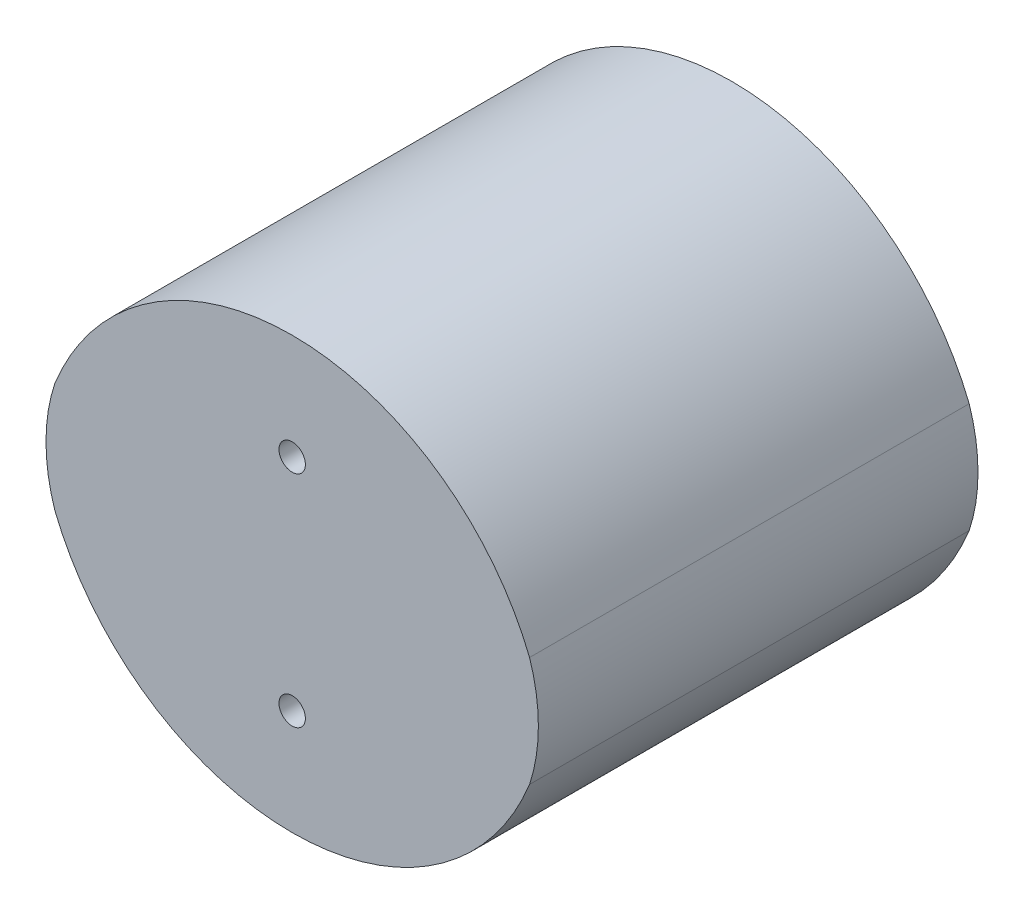
ISO-10303-21;
HEADER;
FILE_DESCRIPTION(('STEP AP214'),'2;1');
FILE_NAME('part.step','',(''),(''),'','','');
FILE_SCHEMA(('AUTOMOTIVE_DESIGN { 1 0 10303 214 1 1 1 1 }'));
ENDSEC;
DATA;
#1=APPLICATION_CONTEXT('core data for automotive mechanical design processes');
#2=APPLICATION_PROTOCOL_DEFINITION('international standard','automotive_design',2000,#1);
#3=PRODUCT_CONTEXT('',#1,'mechanical');
#4=PRODUCT('Part','Part','',(#3));
#5=PRODUCT_RELATED_PRODUCT_CATEGORY('part','',(#4));
#6=PRODUCT_DEFINITION_FORMATION('','',#4);
#7=PRODUCT_DEFINITION_CONTEXT('part definition',#1,'design');
#8=PRODUCT_DEFINITION('design','',#6,#7);
#9=PRODUCT_DEFINITION_SHAPE('','',#8);
#10=(LENGTH_UNIT() NAMED_UNIT(*) SI_UNIT(.MILLI.,.METRE.));
#11=(NAMED_UNIT(*) PLANE_ANGLE_UNIT() SI_UNIT($,.RADIAN.));
#12=(NAMED_UNIT(*) SI_UNIT($,.STERADIAN.) SOLID_ANGLE_UNIT());
#13=UNCERTAINTY_MEASURE_WITH_UNIT(LENGTH_MEASURE(1.E-05),#10,'distance_accuracy_value','');
#14=(GEOMETRIC_REPRESENTATION_CONTEXT(3) GLOBAL_UNCERTAINTY_ASSIGNED_CONTEXT((#13)) GLOBAL_UNIT_ASSIGNED_CONTEXT((#10,
#11,#12)) REPRESENTATION_CONTEXT('',''));
#15=CARTESIAN_POINT('',(0.,0.,0.));
#16=DIRECTION('',(0.,0.,1.));
#17=DIRECTION('',(1.,0.,0.));
#18=AXIS2_PLACEMENT_3D('',#15,#16,#17);
#19=CARTESIAN_POINT('',(4.,-2.2975846996084,0.));
#20=DIRECTION('',(0.,0.,-1.));
#21=DIRECTION('',(-1.,0.,0.));
#22=AXIS2_PLACEMENT_3D('',#19,#20,#21);
#23=PLANE('',#22);
#24=CARTESIAN_POINT('',(0.,12.5,0.));
#25=DIRECTION('',(0.,0.,1.));
#26=DIRECTION('',(1.,0.,0.));
#27=AXIS2_PLACEMENT_3D('',#24,#25,#26);
#28=CIRCLE('',#27,1.49999999999999);
#29=CARTESIAN_POINT('',(1.49999999999999,12.5,0.));
#30=VERTEX_POINT('',#29);
#31=EDGE_CURVE('E116',#30,#30,#28,.T.);
#32=ORIENTED_EDGE('',*,*,#31,.T.);
#33=EDGE_LOOP('',(#32));
#34=FACE_BOUND('',#33,.T.);
#35=CARTESIAN_POINT('',(0.,-4.5951693992168,0.));
#36=DIRECTION('',(0.,0.,1.));
#37=DIRECTION('',(-1.,0.,0.));
#38=AXIS2_PLACEMENT_3D('',#35,#36,#37);
#39=CIRCLE('',#38,29.0951693992168);
#40=CARTESIAN_POINT('',(26.9983551919633,6.25,0.));
#41=VERTEX_POINT('',#40);
#42=CARTESIAN_POINT('',(-26.9983551919633,6.25,0.));
#43=VERTEX_POINT('',#42);
#44=EDGE_CURVE('E97',#41,#43,#39,.T.);
#45=ORIENTED_EDGE('',*,*,#44,.F.);
#46=CARTESIAN_POINT('',(8.,0.,0.));
#47=DIRECTION('',(0.,0.,1.));
#48=DIRECTION('',(-1.,0.,0.));
#49=AXIS2_PLACEMENT_3D('',#46,#47,#48);
#50=CIRCLE('',#49,20.);
#51=CARTESIAN_POINT('',(26.9983551919633,-6.25,0.));
#52=VERTEX_POINT('',#51);
#53=EDGE_CURVE('E73',#52,#41,#50,.T.);
#54=ORIENTED_EDGE('',*,*,#53,.F.);
#55=CARTESIAN_POINT('',(0.,4.5951693992168,0.));
#56=DIRECTION('',(0.,0.,1.));
#57=DIRECTION('',(1.,0.,0.));
#58=AXIS2_PLACEMENT_3D('',#55,#56,#57);
#59=CIRCLE('',#58,29.0951693992168);
#60=CARTESIAN_POINT('',(-26.9983551919633,-6.25,0.));
#61=VERTEX_POINT('',#60);
#62=EDGE_CURVE('E67',#61,#52,#59,.T.);
#63=ORIENTED_EDGE('',*,*,#62,.F.);
#64=CARTESIAN_POINT('',(-8.,0.,0.));
#65=DIRECTION('',(0.,0.,1.));
#66=DIRECTION('',(1.,0.,0.));
#67=AXIS2_PLACEMENT_3D('',#64,#65,#66);
#68=CIRCLE('',#67,20.);
#69=EDGE_CURVE('E89',#43,#61,#68,.T.);
#70=ORIENTED_EDGE('',*,*,#69,.F.);
#71=EDGE_LOOP('',(#45,#54,#63,#70));
#72=FACE_BOUND('',#71,.T.);
#73=CARTESIAN_POINT('',(0.,-12.5,0.));
#74=DIRECTION('',(0.,0.,1.));
#75=DIRECTION('',(1.,0.,0.));
#76=AXIS2_PLACEMENT_3D('',#73,#74,#75);
#77=CIRCLE('',#76,1.49999999999999);
#78=CARTESIAN_POINT('',(1.49999999999999,-12.5,0.));
#79=VERTEX_POINT('',#78);
#80=EDGE_CURVE('E100',#79,#79,#77,.T.);
#81=ORIENTED_EDGE('',*,*,#80,.T.);
#82=EDGE_LOOP('',(#81));
#83=FACE_BOUND('',#82,.T.);
#84=ADVANCED_FACE('F33',(#34,#72,#83),#23,.T.);
#85=CARTESIAN_POINT('',(0.,-4.5951693992168,50.));
#86=DIRECTION('',(0.,0.,-1.));
#87=DIRECTION('',(-1.,0.,0.));
#88=AXIS2_PLACEMENT_3D('',#85,#86,#87);
#89=CYLINDRICAL_SURFACE('',#88,29.0951693992168);
#90=ORIENTED_EDGE('',*,*,#44,.T.);
#91=DIRECTION('',(0.,0.,-1.));
#92=VECTOR('',#91,1.);
#93=CARTESIAN_POINT('',(-26.9983551919633,6.25,50.));
#94=LINE('',#93,#92);
#95=CARTESIAN_POINT('',(-26.9983551919633,6.25,50.));
#96=VERTEX_POINT('',#95);
#97=EDGE_CURVE('E11',#96,#43,#94,.T.);
#98=ORIENTED_EDGE('',*,*,#97,.F.);
#99=CARTESIAN_POINT('',(0.,-4.5951693992168,50.));
#100=DIRECTION('',(0.,0.,1.));
#101=DIRECTION('',(-1.,0.,0.));
#102=AXIS2_PLACEMENT_3D('',#99,#100,#101);
#103=CIRCLE('',#102,29.0951693992168);
#104=CARTESIAN_POINT('',(26.9983551919633,6.25,50.));
#105=VERTEX_POINT('',#104);
#106=EDGE_CURVE('E85',#105,#96,#103,.T.);
#107=ORIENTED_EDGE('',*,*,#106,.F.);
#108=DIRECTION('',(0.,0.,-1.));
#109=VECTOR('',#108,1.);
#110=CARTESIAN_POINT('',(26.9983551919633,6.25,50.));
#111=LINE('',#110,#109);
#112=EDGE_CURVE('E93',#105,#41,#111,.T.);
#113=ORIENTED_EDGE('',*,*,#112,.T.);
#114=EDGE_LOOP('',(#90,#98,#107,#113));
#115=FACE_BOUND('',#114,.T.);
#116=ADVANCED_FACE('F35',(#115),#89,.T.);
#117=CARTESIAN_POINT('',(-8.,0.,50.));
#118=DIRECTION('',(0.,0.,-1.));
#119=DIRECTION('',(-1.,0.,0.));
#120=AXIS2_PLACEMENT_3D('',#117,#118,#119);
#121=CYLINDRICAL_SURFACE('',#120,20.);
#122=ORIENTED_EDGE('',*,*,#69,.T.);
#123=DIRECTION('',(0.,0.,-1.));
#124=VECTOR('',#123,1.);
#125=CARTESIAN_POINT('',(-26.9983551919633,-6.25,50.));
#126=LINE('',#125,#124);
#127=CARTESIAN_POINT('',(-26.9983551919633,-6.25,50.));
#128=VERTEX_POINT('',#127);
#129=EDGE_CURVE('E42',#128,#61,#126,.T.);
#130=ORIENTED_EDGE('',*,*,#129,.F.);
#131=CARTESIAN_POINT('',(-8.,0.,50.));
#132=DIRECTION('',(0.,0.,1.));
#133=DIRECTION('',(1.,0.,0.));
#134=AXIS2_PLACEMENT_3D('',#131,#132,#133);
#135=CIRCLE('',#134,20.);
#136=EDGE_CURVE('E80',#96,#128,#135,.T.);
#137=ORIENTED_EDGE('',*,*,#136,.F.);
#138=ORIENTED_EDGE('',*,*,#97,.T.);
#139=EDGE_LOOP('',(#122,#130,#137,#138));
#140=FACE_BOUND('',#139,.T.);
#141=ADVANCED_FACE('F88',(#140),#121,.T.);
#142=CARTESIAN_POINT('',(0.,4.5951693992168,50.));
#143=DIRECTION('',(0.,0.,-1.));
#144=DIRECTION('',(-1.,0.,0.));
#145=AXIS2_PLACEMENT_3D('',#142,#143,#144);
#146=CYLINDRICAL_SURFACE('',#145,29.0951693992168);
#147=ORIENTED_EDGE('',*,*,#62,.T.);
#148=DIRECTION('',(0.,0.,-1.));
#149=VECTOR('',#148,1.);
#150=CARTESIAN_POINT('',(26.9983551919633,-6.25,50.));
#151=LINE('',#150,#149);
#152=CARTESIAN_POINT('',(26.9983551919633,-6.25,50.));
#153=VERTEX_POINT('',#152);
#154=EDGE_CURVE('E90',#153,#52,#151,.T.);
#155=ORIENTED_EDGE('',*,*,#154,.F.);
#156=CARTESIAN_POINT('',(0.,4.5951693992168,50.));
#157=DIRECTION('',(0.,0.,1.));
#158=DIRECTION('',(1.,0.,0.));
#159=AXIS2_PLACEMENT_3D('',#156,#157,#158);
#160=CIRCLE('',#159,29.0951693992168);
#161=EDGE_CURVE('E83',#128,#153,#160,.T.);
#162=ORIENTED_EDGE('',*,*,#161,.F.);
#163=ORIENTED_EDGE('',*,*,#129,.T.);
#164=EDGE_LOOP('',(#147,#155,#162,#163));
#165=FACE_BOUND('',#164,.T.);
#166=ADVANCED_FACE('F91',(#165),#146,.T.);
#167=CARTESIAN_POINT('',(8.,0.,50.));
#168=DIRECTION('',(0.,0.,-1.));
#169=DIRECTION('',(-1.,0.,0.));
#170=AXIS2_PLACEMENT_3D('',#167,#168,#169);
#171=CYLINDRICAL_SURFACE('',#170,20.);
#172=ORIENTED_EDGE('',*,*,#53,.T.);
#173=ORIENTED_EDGE('',*,*,#112,.F.);
#174=CARTESIAN_POINT('',(8.,0.,50.));
#175=DIRECTION('',(0.,0.,1.));
#176=DIRECTION('',(-1.,0.,0.));
#177=AXIS2_PLACEMENT_3D('',#174,#175,#176);
#178=CIRCLE('',#177,20.);
#179=EDGE_CURVE('E50',#153,#105,#178,.T.);
#180=ORIENTED_EDGE('',*,*,#179,.F.);
#181=ORIENTED_EDGE('',*,*,#154,.T.);
#182=EDGE_LOOP('',(#172,#173,#180,#181));
#183=FACE_BOUND('',#182,.T.);
#184=ADVANCED_FACE('F105',(#183),#171,.T.);
#185=CARTESIAN_POINT('',(4.,-2.2975846996084,50.));
#186=DIRECTION('',(0.,0.,-1.));
#187=DIRECTION('',(-1.,0.,0.));
#188=AXIS2_PLACEMENT_3D('',#185,#186,#187);
#189=PLANE('',#188);
#190=CARTESIAN_POINT('',(0.,12.5,50.));
#191=DIRECTION('',(0.,0.,1.));
#192=DIRECTION('',(1.,0.,0.));
#193=AXIS2_PLACEMENT_3D('',#190,#191,#192);
#194=CIRCLE('',#193,1.5);
#195=CARTESIAN_POINT('',(1.5,12.5,50.));
#196=VERTEX_POINT('',#195);
#197=EDGE_CURVE('E119',#196,#196,#194,.T.);
#198=ORIENTED_EDGE('',*,*,#197,.F.);
#199=EDGE_LOOP('',(#198));
#200=FACE_BOUND('',#199,.T.);
#201=CARTESIAN_POINT('',(0.,-12.5,50.));
#202=DIRECTION('',(0.,0.,1.));
#203=DIRECTION('',(1.,0.,0.));
#204=AXIS2_PLACEMENT_3D('',#201,#202,#203);
#205=CIRCLE('',#204,1.5);
#206=CARTESIAN_POINT('',(1.5,-12.5,50.));
#207=VERTEX_POINT('',#206);
#208=EDGE_CURVE('E113',#207,#207,#205,.T.);
#209=ORIENTED_EDGE('',*,*,#208,.F.);
#210=EDGE_LOOP('',(#209));
#211=FACE_BOUND('',#210,.T.);
#212=ORIENTED_EDGE('',*,*,#106,.T.);
#213=ORIENTED_EDGE('',*,*,#136,.T.);
#214=ORIENTED_EDGE('',*,*,#161,.T.);
#215=ORIENTED_EDGE('',*,*,#179,.T.);
#216=EDGE_LOOP('',(#212,#213,#214,#215));
#217=FACE_BOUND('',#216,.T.);
#218=ADVANCED_FACE('F81',(#200,#211,#217),#189,.F.);
#219=CARTESIAN_POINT('',(0.,-12.5,50.));
#220=DIRECTION('',(0.,0.,1.));
#221=DIRECTION('',(1.,0.,0.));
#222=AXIS2_PLACEMENT_3D('',#219,#220,#221);
#223=CYLINDRICAL_SURFACE('',#222,1.5);
#224=ORIENTED_EDGE('',*,*,#80,.F.);
#225=EDGE_LOOP('',(#224));
#226=FACE_BOUND('',#225,.T.);
#227=ORIENTED_EDGE('',*,*,#208,.T.);
#228=EDGE_LOOP('',(#227));
#229=FACE_BOUND('',#228,.T.);
#230=ADVANCED_FACE('F127',(#226,#229),#223,.F.);
#231=CARTESIAN_POINT('',(0.,12.5,50.));
#232=DIRECTION('',(0.,0.,1.));
#233=DIRECTION('',(1.,0.,0.));
#234=AXIS2_PLACEMENT_3D('',#231,#232,#233);
#235=CYLINDRICAL_SURFACE('',#234,1.5);
#236=ORIENTED_EDGE('',*,*,#31,.F.);
#237=EDGE_LOOP('',(#236));
#238=FACE_BOUND('',#237,.T.);
#239=ORIENTED_EDGE('',*,*,#197,.T.);
#240=EDGE_LOOP('',(#239));
#241=FACE_BOUND('',#240,.T.);
#242=ADVANCED_FACE('F123',(#238,#241),#235,.F.);
#243=CLOSED_SHELL('',(#84,#116,#141,#166,#184,#218,#230,#242));
#244=MANIFOLD_SOLID_BREP('B2',#243);
#245=ADVANCED_BREP_SHAPE_REPRESENTATION('',(#18,#244),#14);
#246=SHAPE_DEFINITION_REPRESENTATION(#9,#245);
ENDSEC;
END-ISO-10303-21;
